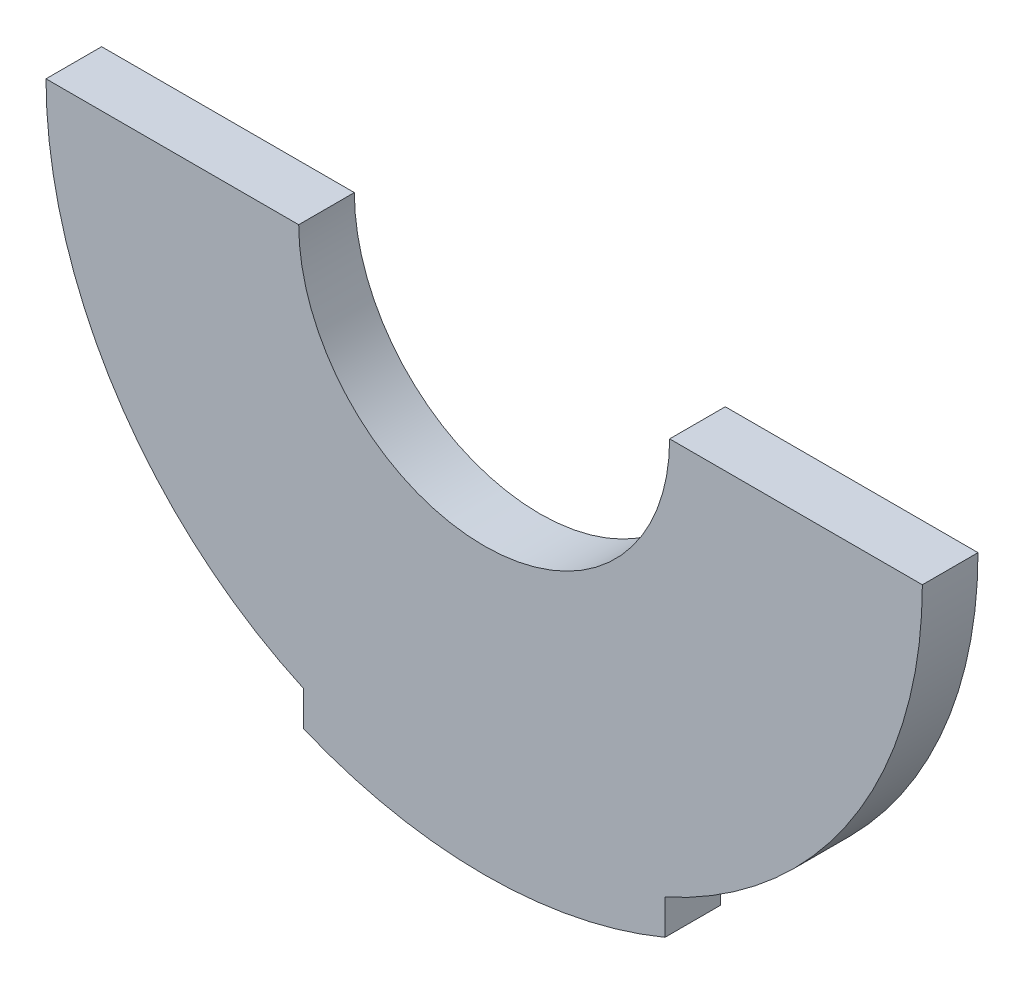
ISO-10303-21;
HEADER;
FILE_DESCRIPTION(('STEP AP214'),'2;1');
FILE_NAME('part.step','',(''),(''),'','','');
FILE_SCHEMA(('AUTOMOTIVE_DESIGN { 1 0 10303 214 1 1 1 1 }'));
ENDSEC;
DATA;
#1=APPLICATION_CONTEXT('core data for automotive mechanical design processes');
#2=APPLICATION_PROTOCOL_DEFINITION('international standard','automotive_design',2000,#1);
#3=PRODUCT_CONTEXT('',#1,'mechanical');
#4=PRODUCT('Part','Part','',(#3));
#5=PRODUCT_RELATED_PRODUCT_CATEGORY('part','',(#4));
#6=PRODUCT_DEFINITION_FORMATION('','',#4);
#7=PRODUCT_DEFINITION_CONTEXT('part definition',#1,'design');
#8=PRODUCT_DEFINITION('design','',#6,#7);
#9=PRODUCT_DEFINITION_SHAPE('','',#8);
#10=(LENGTH_UNIT() NAMED_UNIT(*) SI_UNIT(.MILLI.,.METRE.));
#11=(NAMED_UNIT(*) PLANE_ANGLE_UNIT() SI_UNIT($,.RADIAN.));
#12=(NAMED_UNIT(*) SI_UNIT($,.STERADIAN.) SOLID_ANGLE_UNIT());
#13=UNCERTAINTY_MEASURE_WITH_UNIT(LENGTH_MEASURE(1.E-05),#10,'distance_accuracy_value','');
#14=(GEOMETRIC_REPRESENTATION_CONTEXT(3) GLOBAL_UNCERTAINTY_ASSIGNED_CONTEXT((#13)) GLOBAL_UNIT_ASSIGNED_CONTEXT((#10,
#11,#12)) REPRESENTATION_CONTEXT('',''));
#15=CARTESIAN_POINT('',(0.,0.,0.));
#16=DIRECTION('',(0.,0.,1.));
#17=DIRECTION('',(1.,0.,0.));
#18=AXIS2_PLACEMENT_3D('',#15,#16,#17);
#19=CARTESIAN_POINT('',(0.,0.,6.));
#20=DIRECTION('',(0.,0.,-1.));
#21=DIRECTION('',(-1.,0.,0.));
#22=AXIS2_PLACEMENT_3D('',#19,#20,#21);
#23=CYLINDRICAL_SURFACE('',#22,47.25);
#24=CARTESIAN_POINT('',(0.,0.,0.));
#25=DIRECTION('',(0.,0.,1.));
#26=DIRECTION('',(1.,0.,0.));
#27=AXIS2_PLACEMENT_3D('',#24,#25,#26);
#28=CIRCLE('',#27,47.25);
#29=CARTESIAN_POINT('',(-47.25,0.,0.));
#30=VERTEX_POINT('',#29);
#31=CARTESIAN_POINT('',(-19.5,-43.0385002062107,0.));
#32=VERTEX_POINT('',#31);
#33=EDGE_CURVE('E131',#30,#32,#28,.T.);
#34=ORIENTED_EDGE('',*,*,#33,.T.);
#35=DIRECTION('',(0.,0.,-1.));
#36=VECTOR('',#35,1.);
#37=CARTESIAN_POINT('',(-19.5,-43.0385002062107,6.));
#38=LINE('',#37,#36);
#39=CARTESIAN_POINT('',(-19.5,-43.0385002062107,6.));
#40=VERTEX_POINT('',#39);
#41=EDGE_CURVE('E11',#40,#32,#38,.T.);
#42=ORIENTED_EDGE('',*,*,#41,.F.);
#43=CARTESIAN_POINT('',(0.,0.,6.));
#44=DIRECTION('',(0.,0.,1.));
#45=DIRECTION('',(1.,0.,0.));
#46=AXIS2_PLACEMENT_3D('',#43,#44,#45);
#47=CIRCLE('',#46,47.25);
#48=CARTESIAN_POINT('',(-47.25,0.,6.));
#49=VERTEX_POINT('',#48);
#50=EDGE_CURVE('E150',#49,#40,#47,.T.);
#51=ORIENTED_EDGE('',*,*,#50,.F.);
#52=DIRECTION('',(0.,0.,-1.));
#53=VECTOR('',#52,1.);
#54=CARTESIAN_POINT('',(-47.25,0.,6.));
#55=LINE('',#54,#53);
#56=EDGE_CURVE('E50',#49,#30,#55,.T.);
#57=ORIENTED_EDGE('',*,*,#56,.T.);
#58=EDGE_LOOP('',(#34,#42,#51,#57));
#59=FACE_BOUND('',#58,.T.);
#60=ADVANCED_FACE('F34',(#59),#23,.T.);
#61=CARTESIAN_POINT('',(-19.5,-43.0385002062107,6.));
#62=DIRECTION('',(1.,0.,0.));
#63=DIRECTION('',(0.,0.,-1.));
#64=AXIS2_PLACEMENT_3D('',#61,#62,#63);
#65=PLANE('',#64);
#66=DIRECTION('',(0.,-1.,0.));
#67=VECTOR('',#66,1.);
#68=CARTESIAN_POINT('',(-19.5,-43.0385002062107,0.));
#69=LINE('',#68,#67);
#70=CARTESIAN_POINT('',(-19.5,-46.8,0.));
#71=VERTEX_POINT('',#70);
#72=EDGE_CURVE('E133',#32,#71,#69,.T.);
#73=ORIENTED_EDGE('',*,*,#72,.T.);
#74=DIRECTION('',(0.,0.,-1.));
#75=VECTOR('',#74,1.);
#76=CARTESIAN_POINT('',(-19.5,-46.8,6.));
#77=LINE('',#76,#75);
#78=CARTESIAN_POINT('',(-19.5,-46.8,6.));
#79=VERTEX_POINT('',#78);
#80=EDGE_CURVE('E42',#79,#71,#77,.T.);
#81=ORIENTED_EDGE('',*,*,#80,.F.);
#82=DIRECTION('',(0.,-1.,0.));
#83=VECTOR('',#82,1.);
#84=CARTESIAN_POINT('',(-19.5,-43.0385002062107,6.));
#85=LINE('',#84,#83);
#86=EDGE_CURVE('E88',#40,#79,#85,.T.);
#87=ORIENTED_EDGE('',*,*,#86,.F.);
#88=ORIENTED_EDGE('',*,*,#41,.T.);
#89=EDGE_LOOP('',(#73,#81,#87,#88));
#90=FACE_BOUND('',#89,.T.);
#91=ADVANCED_FACE('F177',(#90),#65,.F.);
#92=CARTESIAN_POINT('',(0.,0.,6.));
#93=DIRECTION('',(0.,0.,-1.));
#94=DIRECTION('',(-1.,0.,0.));
#95=AXIS2_PLACEMENT_3D('',#92,#93,#94);
#96=CYLINDRICAL_SURFACE('',#95,50.7);
#97=CARTESIAN_POINT('',(0.,0.,0.));
#98=DIRECTION('',(0.,0.,1.));
#99=DIRECTION('',(1.,0.,0.));
#100=AXIS2_PLACEMENT_3D('',#97,#98,#99);
#101=CIRCLE('',#100,50.7);
#102=CARTESIAN_POINT('',(19.5,-46.8,0.));
#103=VERTEX_POINT('',#102);
#104=EDGE_CURVE('E135',#71,#103,#101,.T.);
#105=ORIENTED_EDGE('',*,*,#104,.T.);
#106=DIRECTION('',(0.,0.,-1.));
#107=VECTOR('',#106,1.);
#108=CARTESIAN_POINT('',(19.5,-46.8,6.));
#109=LINE('',#108,#107);
#110=CARTESIAN_POINT('',(19.5,-46.8,6.));
#111=VERTEX_POINT('',#110);
#112=EDGE_CURVE('E156',#111,#103,#109,.T.);
#113=ORIENTED_EDGE('',*,*,#112,.F.);
#114=CARTESIAN_POINT('',(0.,0.,6.));
#115=DIRECTION('',(0.,0.,1.));
#116=DIRECTION('',(1.,0.,0.));
#117=AXIS2_PLACEMENT_3D('',#114,#115,#116);
#118=CIRCLE('',#117,50.7);
#119=EDGE_CURVE('E163',#79,#111,#118,.T.);
#120=ORIENTED_EDGE('',*,*,#119,.F.);
#121=ORIENTED_EDGE('',*,*,#80,.T.);
#122=EDGE_LOOP('',(#105,#113,#120,#121));
#123=FACE_BOUND('',#122,.T.);
#124=ADVANCED_FACE('F161',(#123),#96,.T.);
#125=CARTESIAN_POINT('',(19.5,-43.0385002062107,6.));
#126=DIRECTION('',(1.,0.,0.));
#127=DIRECTION('',(0.,1.,0.));
#128=AXIS2_PLACEMENT_3D('',#125,#126,#127);
#129=PLANE('',#128);
#130=DIRECTION('',(0.,-1.,0.));
#131=VECTOR('',#130,1.);
#132=CARTESIAN_POINT('',(19.5,-43.0385002062107,0.));
#133=LINE('',#132,#131);
#134=CARTESIAN_POINT('',(19.5,-43.0385002062107,0.));
#135=VERTEX_POINT('',#134);
#136=EDGE_CURVE('E138',#135,#103,#133,.T.);
#137=ORIENTED_EDGE('',*,*,#136,.F.);
#138=DIRECTION('',(0.,0.,-1.));
#139=VECTOR('',#138,1.);
#140=CARTESIAN_POINT('',(19.5,-43.0385002062107,6.));
#141=LINE('',#140,#139);
#142=CARTESIAN_POINT('',(19.5,-43.0385002062107,6.));
#143=VERTEX_POINT('',#142);
#144=EDGE_CURVE('E154',#143,#135,#141,.T.);
#145=ORIENTED_EDGE('',*,*,#144,.F.);
#146=DIRECTION('',(0.,-1.,0.));
#147=VECTOR('',#146,1.);
#148=CARTESIAN_POINT('',(19.5,-43.0385002062107,6.));
#149=LINE('',#148,#147);
#150=EDGE_CURVE('E171',#143,#111,#149,.T.);
#151=ORIENTED_EDGE('',*,*,#150,.T.);
#152=ORIENTED_EDGE('',*,*,#112,.T.);
#153=EDGE_LOOP('',(#137,#145,#151,#152));
#154=FACE_BOUND('',#153,.T.);
#155=ADVANCED_FACE('F169',(#154),#129,.T.);
#156=CARTESIAN_POINT('',(0.,0.,6.));
#157=DIRECTION('',(0.,0.,-1.));
#158=DIRECTION('',(-1.,0.,0.));
#159=AXIS2_PLACEMENT_3D('',#156,#157,#158);
#160=CYLINDRICAL_SURFACE('',#159,47.25);
#161=CARTESIAN_POINT('',(0.,0.,0.));
#162=DIRECTION('',(0.,0.,1.));
#163=DIRECTION('',(1.,0.,0.));
#164=AXIS2_PLACEMENT_3D('',#161,#162,#163);
#165=CIRCLE('',#164,47.25);
#166=CARTESIAN_POINT('',(47.25,0.,0.));
#167=VERTEX_POINT('',#166);
#168=EDGE_CURVE('E141',#135,#167,#165,.T.);
#169=ORIENTED_EDGE('',*,*,#168,.T.);
#170=DIRECTION('',(0.,0.,-1.));
#171=VECTOR('',#170,1.);
#172=CARTESIAN_POINT('',(47.25,0.,6.));
#173=LINE('',#172,#171);
#174=CARTESIAN_POINT('',(47.25,0.,6.));
#175=VERTEX_POINT('',#174);
#176=EDGE_CURVE('E113',#175,#167,#173,.T.);
#177=ORIENTED_EDGE('',*,*,#176,.F.);
#178=CARTESIAN_POINT('',(0.,0.,6.));
#179=DIRECTION('',(0.,0.,1.));
#180=DIRECTION('',(1.,0.,0.));
#181=AXIS2_PLACEMENT_3D('',#178,#179,#180);
#182=CIRCLE('',#181,47.25);
#183=EDGE_CURVE('E122',#143,#175,#182,.T.);
#184=ORIENTED_EDGE('',*,*,#183,.F.);
#185=ORIENTED_EDGE('',*,*,#144,.T.);
#186=EDGE_LOOP('',(#169,#177,#184,#185));
#187=FACE_BOUND('',#186,.T.);
#188=ADVANCED_FACE('F187',(#187),#160,.T.);
#189=CARTESIAN_POINT('',(20.,0.,6.));
#190=DIRECTION('',(0.,1.,0.));
#191=DIRECTION('',(0.,0.,1.));
#192=AXIS2_PLACEMENT_3D('',#189,#190,#191);
#193=PLANE('',#192);
#194=DIRECTION('',(1.,0.,0.));
#195=VECTOR('',#194,1.);
#196=CARTESIAN_POINT('',(20.,0.,0.));
#197=LINE('',#196,#195);
#198=CARTESIAN_POINT('',(20.,0.,0.));
#199=VERTEX_POINT('',#198);
#200=EDGE_CURVE('E109',#199,#167,#197,.T.);
#201=ORIENTED_EDGE('',*,*,#200,.F.);
#202=DIRECTION('',(0.,0.,-1.));
#203=VECTOR('',#202,1.);
#204=CARTESIAN_POINT('',(20.,0.,6.));
#205=LINE('',#204,#203);
#206=CARTESIAN_POINT('',(20.,0.,6.));
#207=VERTEX_POINT('',#206);
#208=EDGE_CURVE('E104',#207,#199,#205,.T.);
#209=ORIENTED_EDGE('',*,*,#208,.F.);
#210=DIRECTION('',(1.,0.,0.));
#211=VECTOR('',#210,1.);
#212=CARTESIAN_POINT('',(20.,0.,6.));
#213=LINE('',#212,#211);
#214=EDGE_CURVE('E107',#207,#175,#213,.T.);
#215=ORIENTED_EDGE('',*,*,#214,.T.);
#216=ORIENTED_EDGE('',*,*,#176,.T.);
#217=EDGE_LOOP('',(#201,#209,#215,#216));
#218=FACE_BOUND('',#217,.T.);
#219=ADVANCED_FACE('F106',(#218),#193,.T.);
#220=CARTESIAN_POINT('',(0.,0.,6.));
#221=DIRECTION('',(0.,0.,-1.));
#222=DIRECTION('',(-1.,0.,0.));
#223=AXIS2_PLACEMENT_3D('',#220,#221,#222);
#224=CYLINDRICAL_SURFACE('',#223,20.);
#225=CARTESIAN_POINT('',(0.,0.,0.));
#226=DIRECTION('',(0.,0.,1.));
#227=DIRECTION('',(1.,0.,0.));
#228=AXIS2_PLACEMENT_3D('',#225,#226,#227);
#229=CIRCLE('',#228,20.);
#230=CARTESIAN_POINT('',(-20.,0.,0.));
#231=VERTEX_POINT('',#230);
#232=EDGE_CURVE('E145',#231,#199,#229,.T.);
#233=ORIENTED_EDGE('',*,*,#232,.F.);
#234=DIRECTION('',(0.,0.,-1.));
#235=VECTOR('',#234,1.);
#236=CARTESIAN_POINT('',(-20.,0.,6.));
#237=LINE('',#236,#235);
#238=CARTESIAN_POINT('',(-20.,0.,6.));
#239=VERTEX_POINT('',#238);
#240=EDGE_CURVE('E76',#239,#231,#237,.T.);
#241=ORIENTED_EDGE('',*,*,#240,.F.);
#242=CARTESIAN_POINT('',(0.,0.,6.));
#243=DIRECTION('',(0.,0.,1.));
#244=DIRECTION('',(1.,0.,0.));
#245=AXIS2_PLACEMENT_3D('',#242,#243,#244);
#246=CIRCLE('',#245,20.);
#247=EDGE_CURVE('E119',#239,#207,#246,.T.);
#248=ORIENTED_EDGE('',*,*,#247,.T.);
#249=ORIENTED_EDGE('',*,*,#208,.T.);
#250=EDGE_LOOP('',(#233,#241,#248,#249));
#251=FACE_BOUND('',#250,.T.);
#252=ADVANCED_FACE('F125',(#251),#224,.F.);
#253=CARTESIAN_POINT('',(-47.25,0.,6.));
#254=DIRECTION('',(0.,1.,0.));
#255=DIRECTION('',(0.,0.,1.));
#256=AXIS2_PLACEMENT_3D('',#253,#254,#255);
#257=PLANE('',#256);
#258=DIRECTION('',(1.,0.,0.));
#259=VECTOR('',#258,1.);
#260=CARTESIAN_POINT('',(-47.25,0.,0.));
#261=LINE('',#260,#259);
#262=EDGE_CURVE('E147',#30,#231,#261,.T.);
#263=ORIENTED_EDGE('',*,*,#262,.F.);
#264=ORIENTED_EDGE('',*,*,#56,.F.);
#265=DIRECTION('',(1.,0.,0.));
#266=VECTOR('',#265,1.);
#267=CARTESIAN_POINT('',(-47.25,0.,6.));
#268=LINE('',#267,#266);
#269=EDGE_CURVE('E126',#49,#239,#268,.T.);
#270=ORIENTED_EDGE('',*,*,#269,.T.);
#271=ORIENTED_EDGE('',*,*,#240,.T.);
#272=EDGE_LOOP('',(#263,#264,#270,#271));
#273=FACE_BOUND('',#272,.T.);
#274=ADVANCED_FACE('F195',(#273),#257,.T.);
#275=CARTESIAN_POINT('',(0.,0.,6.));
#276=DIRECTION('',(0.,0.,1.));
#277=DIRECTION('',(1.,0.,0.));
#278=AXIS2_PLACEMENT_3D('',#275,#276,#277);
#279=PLANE('',#278);
#280=ORIENTED_EDGE('',*,*,#50,.T.);
#281=ORIENTED_EDGE('',*,*,#86,.T.);
#282=ORIENTED_EDGE('',*,*,#119,.T.);
#283=ORIENTED_EDGE('',*,*,#150,.F.);
#284=ORIENTED_EDGE('',*,*,#183,.T.);
#285=ORIENTED_EDGE('',*,*,#214,.F.);
#286=ORIENTED_EDGE('',*,*,#247,.F.);
#287=ORIENTED_EDGE('',*,*,#269,.F.);
#288=EDGE_LOOP('',(#280,#281,#282,#283,#284,#285,#286,#287));
#289=FACE_BOUND('',#288,.T.);
#290=ADVANCED_FACE('F117',(#289),#279,.T.);
#291=CARTESIAN_POINT('',(0.,0.,0.));
#292=DIRECTION('',(0.,0.,1.));
#293=DIRECTION('',(1.,0.,0.));
#294=AXIS2_PLACEMENT_3D('',#291,#292,#293);
#295=PLANE('',#294);
#296=ORIENTED_EDGE('',*,*,#33,.F.);
#297=ORIENTED_EDGE('',*,*,#262,.T.);
#298=ORIENTED_EDGE('',*,*,#232,.T.);
#299=ORIENTED_EDGE('',*,*,#200,.T.);
#300=ORIENTED_EDGE('',*,*,#168,.F.);
#301=ORIENTED_EDGE('',*,*,#136,.T.);
#302=ORIENTED_EDGE('',*,*,#104,.F.);
#303=ORIENTED_EDGE('',*,*,#72,.F.);
#304=EDGE_LOOP('',(#296,#297,#298,#299,#300,#301,#302,#303));
#305=FACE_BOUND('',#304,.T.);
#306=ADVANCED_FACE('F165',(#305),#295,.F.);
#307=CLOSED_SHELL('',(#60,#91,#124,#155,#188,#219,#252,#274,#290,#306));
#308=MANIFOLD_SOLID_BREP('B2',#307);
#309=ADVANCED_BREP_SHAPE_REPRESENTATION('',(#18,#308),#14);
#310=SHAPE_DEFINITION_REPRESENTATION(#9,#309);
ENDSEC;
END-ISO-10303-21;
